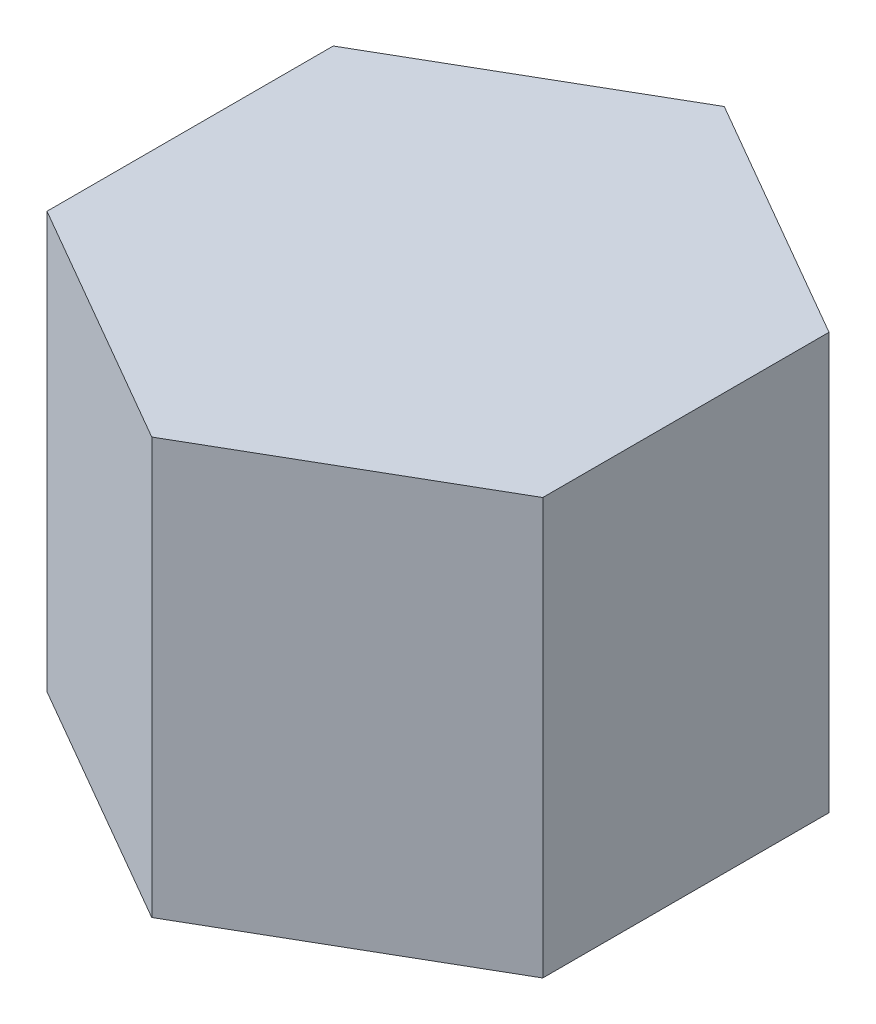
ISO-10303-21;
HEADER;
FILE_DESCRIPTION(('STEP AP214'),'2;1');
FILE_NAME('part.step','',(''),(''),'','','');
FILE_SCHEMA(('AUTOMOTIVE_DESIGN { 1 0 10303 214 1 1 1 1 }'));
ENDSEC;
DATA;
#1=APPLICATION_CONTEXT('core data for automotive mechanical design processes');
#2=APPLICATION_PROTOCOL_DEFINITION('international standard','automotive_design',2000,#1);
#3=PRODUCT_CONTEXT('',#1,'mechanical');
#4=PRODUCT('Part','Part','',(#3));
#5=PRODUCT_RELATED_PRODUCT_CATEGORY('part','',(#4));
#6=PRODUCT_DEFINITION_FORMATION('','',#4);
#7=PRODUCT_DEFINITION_CONTEXT('part definition',#1,'design');
#8=PRODUCT_DEFINITION('design','',#6,#7);
#9=PRODUCT_DEFINITION_SHAPE('','',#8);
#10=(LENGTH_UNIT() NAMED_UNIT(*) SI_UNIT(.MILLI.,.METRE.));
#11=(NAMED_UNIT(*) PLANE_ANGLE_UNIT() SI_UNIT($,.RADIAN.));
#12=(NAMED_UNIT(*) SI_UNIT($,.STERADIAN.) SOLID_ANGLE_UNIT());
#13=UNCERTAINTY_MEASURE_WITH_UNIT(LENGTH_MEASURE(1.E-05),#10,'distance_accuracy_value','');
#14=(GEOMETRIC_REPRESENTATION_CONTEXT(3) GLOBAL_UNCERTAINTY_ASSIGNED_CONTEXT((#13)) GLOBAL_UNIT_ASSIGNED_CONTEXT((#10,
#11,#12)) REPRESENTATION_CONTEXT('',''));
#15=CARTESIAN_POINT('',(0.,0.,0.));
#16=DIRECTION('',(0.,0.,1.));
#17=DIRECTION('',(1.,0.,0.));
#18=AXIS2_PLACEMENT_3D('',#15,#16,#17);
#19=CARTESIAN_POINT('',(208.339551417382,-147.556598747966,291.681971220494));
#20=DIRECTION('',(-0.500000000000028,0.,-0.866025403784422));
#21=DIRECTION('',(-0.866025403784423,0.,0.500000000000028));
#22=AXIS2_PLACEMENT_3D('',#19,#20,#21);
#23=PLANE('',#22);
#24=CARTESIAN_POINT('',(208.642660308706,-147.047793579175,291.506971220494));
#25=DIRECTION('',(-0.866025403784422,0.,0.500000000000028));
#26=VECTOR('',#25,1.);
#27=LINE('',#24,#26);
#28=CARTESIAN_POINT('',(208.642660308706,-147.047793579175,291.506971220494));
#29=VERTEX_POINT('',#28);
#30=CARTESIAN_POINT('',(208.339551417382,-147.047793579175,291.681971220494));
#31=VERTEX_POINT('',#30);
#32=EDGE_CURVE('E170',#29,#31,#27,.T.);
#33=ORIENTED_EDGE('',*,*,#32,.T.);
#34=CARTESIAN_POINT('',(208.339551417382,-147.556598747966,291.681971220494));
#35=DIRECTION('',(0.,1.,0.));
#36=VECTOR('',#35,1.);
#37=LINE('',#34,#36);
#38=CARTESIAN_POINT('',(208.339551417382,-147.556598747966,291.681971220494));
#39=VERTEX_POINT('',#38);
#40=EDGE_CURVE('E35',#39,#31,#37,.T.);
#41=ORIENTED_EDGE('',*,*,#40,.F.);
#42=CARTESIAN_POINT('',(208.642660308706,-147.556598747966,291.506971220494));
#43=DIRECTION('',(-0.866025403784422,0.,0.500000000000028));
#44=VECTOR('',#43,1.);
#45=LINE('',#42,#44);
#46=CARTESIAN_POINT('',(208.642660308706,-147.556598747966,291.506971220494));
#47=VERTEX_POINT('',#46);
#48=EDGE_CURVE('E159',#47,#39,#45,.T.);
#49=ORIENTED_EDGE('',*,*,#48,.F.);
#50=CARTESIAN_POINT('',(208.642660308706,-147.556598747966,291.506971220494));
#51=DIRECTION('',(0.,1.,0.));
#52=VECTOR('',#51,1.);
#53=LINE('',#50,#52);
#54=EDGE_CURVE('E10',#47,#29,#53,.T.);
#55=ORIENTED_EDGE('',*,*,#54,.T.);
#56=EDGE_LOOP('',(#33,#41,#49,#55));
#57=FACE_BOUND('',#56,.T.);
#58=ADVANCED_FACE('F16',(#57),#23,.F.);
#59=CARTESIAN_POINT('',(208.642660308706,-147.556598747966,291.594471220494));
#60=DIRECTION('',(-1.,0.,0.));
#61=DIRECTION('',(0.,-1.,0.));
#62=AXIS2_PLACEMENT_3D('',#59,#60,#61);
#63=PLANE('',#62);
#64=CARTESIAN_POINT('',(208.642660308706,-147.047793579175,291.156971220494));
#65=DIRECTION('',(0.,0.,1.));
#66=VECTOR('',#65,1.);
#67=LINE('',#64,#66);
#68=CARTESIAN_POINT('',(208.642660308706,-147.047793579175,291.156971220494));
#69=VERTEX_POINT('',#68);
#70=EDGE_CURVE('E167',#69,#29,#67,.T.);
#71=ORIENTED_EDGE('',*,*,#70,.T.);
#72=ORIENTED_EDGE('',*,*,#54,.F.);
#73=CARTESIAN_POINT('',(208.642660308706,-147.556598747966,291.156971220494));
#74=DIRECTION('',(0.,0.,1.));
#75=VECTOR('',#74,1.);
#76=LINE('',#73,#75);
#77=CARTESIAN_POINT('',(208.642660308706,-147.556598747966,291.156971220494));
#78=VERTEX_POINT('',#77);
#79=EDGE_CURVE('E156',#78,#47,#76,.T.);
#80=ORIENTED_EDGE('',*,*,#79,.F.);
#81=CARTESIAN_POINT('',(208.642660308706,-147.556598747966,291.156971220494));
#82=DIRECTION('',(0.,1.,0.));
#83=VECTOR('',#82,1.);
#84=LINE('',#81,#83);
#85=EDGE_CURVE('E27',#78,#69,#84,.T.);
#86=ORIENTED_EDGE('',*,*,#85,.T.);
#87=EDGE_LOOP('',(#71,#72,#80,#86));
#88=FACE_BOUND('',#87,.T.);
#89=ADVANCED_FACE('F189',(#88),#63,.F.);
#90=CARTESIAN_POINT('',(208.642660308706,-147.556598747966,291.156971220494));
#91=DIRECTION('',(-0.500000000000028,0.,0.866025403784422));
#92=DIRECTION('',(0.866025403784423,0.,0.500000000000028));
#93=AXIS2_PLACEMENT_3D('',#90,#91,#92);
#94=PLANE('',#93);
#95=CARTESIAN_POINT('',(208.339551417381,-147.047793579175,290.981971220494));
#96=DIRECTION('',(0.866025403784422,0.,0.500000000000028));
#97=VECTOR('',#96,1.);
#98=LINE('',#95,#97);
#99=CARTESIAN_POINT('',(208.339551417382,-147.047793579175,290.981971220494));
#100=VERTEX_POINT('',#99);
#101=EDGE_CURVE('E163',#100,#69,#98,.T.);
#102=ORIENTED_EDGE('',*,*,#101,.T.);
#103=ORIENTED_EDGE('',*,*,#85,.F.);
#104=CARTESIAN_POINT('',(208.339551417381,-147.556598747966,290.981971220494));
#105=DIRECTION('',(0.866025403784422,0.,0.500000000000028));
#106=VECTOR('',#105,1.);
#107=LINE('',#104,#106);
#108=CARTESIAN_POINT('',(208.339551417382,-147.556598747966,290.981971220494));
#109=VERTEX_POINT('',#108);
#110=EDGE_CURVE('E106',#109,#78,#107,.T.);
#111=ORIENTED_EDGE('',*,*,#110,.F.);
#112=CARTESIAN_POINT('',(208.339551417382,-147.556598747966,290.981971220494));
#113=DIRECTION('',(0.,1.,0.));
#114=VECTOR('',#113,1.);
#115=LINE('',#112,#114);
#116=EDGE_CURVE('E94',#109,#100,#115,.T.);
#117=ORIENTED_EDGE('',*,*,#116,.T.);
#118=EDGE_LOOP('',(#102,#103,#111,#117));
#119=FACE_BOUND('',#118,.T.);
#120=ADVANCED_FACE('F198',(#119),#94,.F.);
#121=CARTESIAN_POINT('',(208.339551417382,-147.556598747966,290.981971220494));
#122=DIRECTION('',(0.499999999999943,0.,0.866025403784471));
#123=DIRECTION('',(0.866025403784471,0.,-0.499999999999943));
#124=AXIS2_PLACEMENT_3D('',#121,#122,#123);
#125=PLANE('',#124);
#126=CARTESIAN_POINT('',(208.036442526057,-147.047793579175,291.156971220494));
#127=DIRECTION('',(0.866025403784471,0.,-0.499999999999943));
#128=VECTOR('',#127,1.);
#129=LINE('',#126,#128);
#130=CARTESIAN_POINT('',(208.036442526057,-147.047793579175,291.156971220494));
#131=VERTEX_POINT('',#130);
#132=EDGE_CURVE('E162',#131,#100,#129,.T.);
#133=ORIENTED_EDGE('',*,*,#132,.T.);
#134=ORIENTED_EDGE('',*,*,#116,.F.);
#135=CARTESIAN_POINT('',(208.036442526057,-147.556598747966,291.156971220494));
#136=DIRECTION('',(0.866025403784471,0.,-0.499999999999943));
#137=VECTOR('',#136,1.);
#138=LINE('',#135,#137);
#139=CARTESIAN_POINT('',(208.036442526057,-147.556598747966,291.156971220494));
#140=VERTEX_POINT('',#139);
#141=EDGE_CURVE('E98',#140,#109,#138,.T.);
#142=ORIENTED_EDGE('',*,*,#141,.F.);
#143=CARTESIAN_POINT('',(208.036442526057,-147.556598747966,291.156971220494));
#144=DIRECTION('',(0.,1.,0.));
#145=VECTOR('',#144,1.);
#146=LINE('',#143,#145);
#147=EDGE_CURVE('E79',#140,#131,#146,.T.);
#148=ORIENTED_EDGE('',*,*,#147,.T.);
#149=EDGE_LOOP('',(#133,#134,#142,#148));
#150=FACE_BOUND('',#149,.T.);
#151=ADVANCED_FACE('F100',(#150),#125,.F.);
#152=CARTESIAN_POINT('',(208.036442526057,-147.556598747966,291.594471220494));
#153=DIRECTION('',(1.,0.,0.));
#154=DIRECTION('',(0.,1.,0.));
#155=AXIS2_PLACEMENT_3D('',#152,#153,#154);
#156=PLANE('',#155);
#157=CARTESIAN_POINT('',(208.036442526057,-147.047793579175,291.506971220494));
#158=DIRECTION('',(0.,0.,-1.));
#159=VECTOR('',#158,1.);
#160=LINE('',#157,#159);
#161=CARTESIAN_POINT('',(208.036442526057,-147.047793579175,291.506971220494));
#162=VERTEX_POINT('',#161);
#163=EDGE_CURVE('E88',#162,#131,#160,.T.);
#164=ORIENTED_EDGE('',*,*,#163,.T.);
#165=ORIENTED_EDGE('',*,*,#147,.F.);
#166=CARTESIAN_POINT('',(208.036442526057,-147.556598747966,291.506971220494));
#167=DIRECTION('',(0.,0.,-1.));
#168=VECTOR('',#167,1.);
#169=LINE('',#166,#168);
#170=CARTESIAN_POINT('',(208.036442526057,-147.556598747966,291.506971220494));
#171=VERTEX_POINT('',#170);
#172=EDGE_CURVE('E84',#171,#140,#169,.T.);
#173=ORIENTED_EDGE('',*,*,#172,.F.);
#174=CARTESIAN_POINT('',(208.036442526057,-147.556598747966,291.506971220494));
#175=DIRECTION('',(0.,1.,0.));
#176=VECTOR('',#175,1.);
#177=LINE('',#174,#176);
#178=EDGE_CURVE('E58',#171,#162,#177,.T.);
#179=ORIENTED_EDGE('',*,*,#178,.T.);
#180=EDGE_LOOP('',(#164,#165,#173,#179));
#181=FACE_BOUND('',#180,.T.);
#182=ADVANCED_FACE('F82',(#181),#156,.F.);
#183=CARTESIAN_POINT('',(208.036442526057,-147.556598747966,291.506971220494));
#184=DIRECTION('',(0.499999999999978,0.,-0.866025403784452));
#185=DIRECTION('',(-0.866025403784452,0.,-0.499999999999978));
#186=AXIS2_PLACEMENT_3D('',#183,#184,#185);
#187=PLANE('',#186);
#188=CARTESIAN_POINT('',(208.339551417382,-147.047793579175,291.681971220494));
#189=DIRECTION('',(-0.866025403784452,0.,-0.499999999999978));
#190=VECTOR('',#189,1.);
#191=LINE('',#188,#190);
#192=EDGE_CURVE('E160',#31,#162,#191,.T.);
#193=ORIENTED_EDGE('',*,*,#192,.T.);
#194=ORIENTED_EDGE('',*,*,#178,.F.);
#195=CARTESIAN_POINT('',(208.339551417382,-147.556598747966,291.681971220494));
#196=DIRECTION('',(-0.866025403784452,0.,-0.499999999999978));
#197=VECTOR('',#196,1.);
#198=LINE('',#195,#197);
#199=EDGE_CURVE('E112',#39,#171,#198,.T.);
#200=ORIENTED_EDGE('',*,*,#199,.F.);
#201=ORIENTED_EDGE('',*,*,#40,.T.);
#202=EDGE_LOOP('',(#193,#194,#200,#201));
#203=FACE_BOUND('',#202,.T.);
#204=ADVANCED_FACE('F131',(#203),#187,.F.);
#205=CARTESIAN_POINT('',(206.491105863044,-147.556598747966,291.594471220494));
#206=DIRECTION('',(0.,1.,0.));
#207=DIRECTION('',(-1.,0.,0.));
#208=AXIS2_PLACEMENT_3D('',#205,#206,#207);
#209=PLANE('',#208);
#210=ORIENTED_EDGE('',*,*,#48,.T.);
#211=ORIENTED_EDGE('',*,*,#199,.T.);
#212=ORIENTED_EDGE('',*,*,#172,.T.);
#213=ORIENTED_EDGE('',*,*,#141,.T.);
#214=ORIENTED_EDGE('',*,*,#110,.T.);
#215=ORIENTED_EDGE('',*,*,#79,.T.);
#216=EDGE_LOOP('',(#210,#211,#212,#213,#214,#215));
#217=FACE_BOUND('',#216,.T.);
#218=ADVANCED_FACE('F111',(#217),#209,.F.);
#219=CARTESIAN_POINT('',(206.491105863044,-147.047793579175,291.594471220494));
#220=DIRECTION('',(0.,1.,0.));
#221=DIRECTION('',(-1.,0.,0.));
#222=AXIS2_PLACEMENT_3D('',#219,#220,#221);
#223=PLANE('',#222);
#224=ORIENTED_EDGE('',*,*,#32,.F.);
#225=ORIENTED_EDGE('',*,*,#70,.F.);
#226=ORIENTED_EDGE('',*,*,#101,.F.);
#227=ORIENTED_EDGE('',*,*,#132,.F.);
#228=ORIENTED_EDGE('',*,*,#163,.F.);
#229=ORIENTED_EDGE('',*,*,#192,.F.);
#230=EDGE_LOOP('',(#224,#225,#226,#227,#228,#229));
#231=FACE_BOUND('',#230,.T.);
#232=ADVANCED_FACE('F130',(#231),#223,.T.);
#233=CLOSED_SHELL('',(#58,#89,#120,#151,#182,#204,#218,#232));
#234=MANIFOLD_SOLID_BREP('B1',#233);
#235=ADVANCED_BREP_SHAPE_REPRESENTATION('',(#18,#234),#14);
#236=SHAPE_DEFINITION_REPRESENTATION(#9,#235);
ENDSEC;
END-ISO-10303-21;
